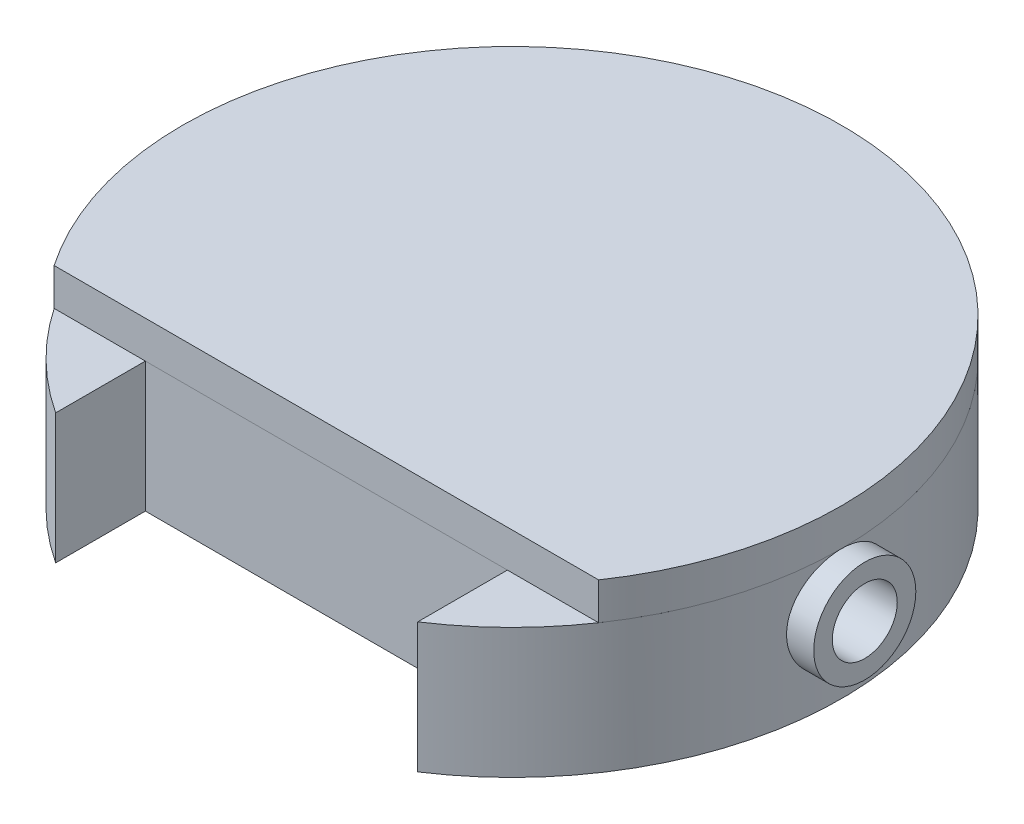
ISO-10303-21;
HEADER;
FILE_DESCRIPTION(('STEP AP214'),'2;1');
FILE_NAME('part.step','',(''),(''),'','','');
FILE_SCHEMA(('AUTOMOTIVE_DESIGN { 1 0 10303 214 1 1 1 1 }'));
ENDSEC;
DATA;
#1=APPLICATION_CONTEXT('core data for automotive mechanical design processes');
#2=APPLICATION_PROTOCOL_DEFINITION('international standard','automotive_design',2000,#1);
#3=PRODUCT_CONTEXT('',#1,'mechanical');
#4=PRODUCT('Part','Part','',(#3));
#5=PRODUCT_RELATED_PRODUCT_CATEGORY('part','',(#4));
#6=PRODUCT_DEFINITION_FORMATION('','',#4);
#7=PRODUCT_DEFINITION_CONTEXT('part definition',#1,'design');
#8=PRODUCT_DEFINITION('design','',#6,#7);
#9=PRODUCT_DEFINITION_SHAPE('','',#8);
#10=(LENGTH_UNIT() NAMED_UNIT(*) SI_UNIT(.MILLI.,.METRE.));
#11=(NAMED_UNIT(*) PLANE_ANGLE_UNIT() SI_UNIT($,.RADIAN.));
#12=(NAMED_UNIT(*) SI_UNIT($,.STERADIAN.) SOLID_ANGLE_UNIT());
#13=UNCERTAINTY_MEASURE_WITH_UNIT(LENGTH_MEASURE(1.E-05),#10,'distance_accuracy_value','');
#14=(GEOMETRIC_REPRESENTATION_CONTEXT(3) GLOBAL_UNCERTAINTY_ASSIGNED_CONTEXT((#13)) GLOBAL_UNIT_ASSIGNED_CONTEXT((#10,
#11,#12)) REPRESENTATION_CONTEXT('',''));
#15=CARTESIAN_POINT('',(0.,0.,0.));
#16=DIRECTION('',(0.,0.,1.));
#17=DIRECTION('',(1.,0.,0.));
#18=AXIS2_PLACEMENT_3D('',#15,#16,#17);
#19=CARTESIAN_POINT('',(-17.7812127220935,-2.51992037915481,11.7403163045634));
#20=DIRECTION('',(0.,-1.,0.));
#21=DIRECTION('',(0.,0.,-1.));
#22=AXIS2_PLACEMENT_3D('',#19,#20,#21);
#23=CYLINDRICAL_SURFACE('',#22,3.55);
#24=CARTESIAN_POINT('',(-17.7812127220935,-2.91992037915481,11.7403163045634));
#25=DIRECTION('',(0.,1.,0.));
#26=DIRECTION('',(0.,0.,1.));
#27=AXIS2_PLACEMENT_3D('',#24,#25,#26);
#28=CIRCLE('',#27,3.55);
#29=CARTESIAN_POINT('',(-14.848210846881,-2.91992037915481,13.7403163045634));
#30=VERTEX_POINT('',#29);
#31=CARTESIAN_POINT('',(-20.714214597306,-2.91992037915481,13.7403163045634));
#32=VERTEX_POINT('',#31);
#33=EDGE_CURVE('E78',#30,#32,#28,.T.);
#34=ORIENTED_EDGE('',*,*,#33,.T.);
#35=DIRECTION('',(0.,-1.,0.));
#36=VECTOR('',#35,1.);
#37=CARTESIAN_POINT('',(-20.714214597306,-2.51992037915481,13.7403163045634));
#38=LINE('',#37,#36);
#39=CARTESIAN_POINT('',(-20.714214597306,-2.51992037915481,13.7403163045634));
#40=VERTEX_POINT('',#39);
#41=EDGE_CURVE('E12',#40,#32,#38,.T.);
#42=ORIENTED_EDGE('',*,*,#41,.F.);
#43=CARTESIAN_POINT('',(-17.7812127220935,-2.51992037915481,11.7403163045634));
#44=DIRECTION('',(0.,1.,0.));
#45=DIRECTION('',(0.,0.,1.));
#46=AXIS2_PLACEMENT_3D('',#43,#44,#45);
#47=CIRCLE('',#46,3.55);
#48=CARTESIAN_POINT('',(-14.848210846881,-2.51992037915481,13.7403163045634));
#49=VERTEX_POINT('',#48);
#50=EDGE_CURVE('E77',#49,#40,#47,.T.);
#51=ORIENTED_EDGE('',*,*,#50,.F.);
#52=DIRECTION('',(0.,-1.,0.));
#53=VECTOR('',#52,1.);
#54=CARTESIAN_POINT('',(-14.848210846881,-2.51992037915481,13.7403163045634));
#55=LINE('',#54,#53);
#56=EDGE_CURVE('E55',#49,#30,#55,.T.);
#57=ORIENTED_EDGE('',*,*,#56,.T.);
#58=EDGE_LOOP('',(#34,#42,#51,#57));
#59=FACE_BOUND('',#58,.T.);
#60=ADVANCED_FACE('F47',(#59),#23,.T.);
#61=CARTESIAN_POINT('',(-20.714214597306,-2.51992037915481,13.7403163045634));
#62=DIRECTION('',(0.,0.,-1.));
#63=DIRECTION('',(-1.,0.,0.));
#64=AXIS2_PLACEMENT_3D('',#61,#62,#63);
#65=PLANE('',#64);
#66=DIRECTION('',(1.,0.,0.));
#67=VECTOR('',#66,1.);
#68=CARTESIAN_POINT('',(-20.714214597306,-2.91992037915481,13.7403163045634));
#69=LINE('',#68,#67);
#70=EDGE_CURVE('E70',#32,#30,#69,.T.);
#71=ORIENTED_EDGE('',*,*,#70,.T.);
#72=ORIENTED_EDGE('',*,*,#56,.F.);
#73=DIRECTION('',(1.,0.,0.));
#74=VECTOR('',#73,1.);
#75=CARTESIAN_POINT('',(-20.714214597306,-2.51992037915481,13.7403163045634));
#76=LINE('',#75,#74);
#77=EDGE_CURVE('E62',#40,#49,#76,.T.);
#78=ORIENTED_EDGE('',*,*,#77,.F.);
#79=ORIENTED_EDGE('',*,*,#41,.T.);
#80=EDGE_LOOP('',(#71,#72,#78,#79));
#81=FACE_BOUND('',#80,.T.);
#82=ADVANCED_FACE('F73',(#81),#65,.F.);
#83=CARTESIAN_POINT('',(-17.7812127220935,-2.51992037915481,11.7403163045634));
#84=DIRECTION('',(0.,1.,0.));
#85=DIRECTION('',(0.,0.,1.));
#86=AXIS2_PLACEMENT_3D('',#83,#84,#85);
#87=PLANE('',#86);
#88=ORIENTED_EDGE('',*,*,#50,.T.);
#89=ORIENTED_EDGE('',*,*,#77,.T.);
#90=EDGE_LOOP('',(#88,#89));
#91=FACE_BOUND('',#90,.T.);
#92=ADVANCED_FACE('F85',(#91),#87,.T.);
#93=CARTESIAN_POINT('',(-17.7812127220935,-2.91992037915481,11.7403163045634));
#94=DIRECTION('',(0.,1.,0.));
#95=DIRECTION('',(0.,0.,1.));
#96=AXIS2_PLACEMENT_3D('',#93,#94,#95);
#97=PLANE('',#96);
#98=ORIENTED_EDGE('',*,*,#33,.F.);
#99=ORIENTED_EDGE('',*,*,#70,.F.);
#100=EDGE_LOOP('',(#98,#99));
#101=FACE_BOUND('',#100,.T.);
#102=ADVANCED_FACE('F81',(#101),#97,.F.);
#103=CLOSED_SHELL('',(#60,#82,#92,#102));
#104=MANIFOLD_SOLID_BREP('B2',#103);
#105=CARTESIAN_POINT('',(-20.4312127220935,-4.31992037915481,11.2403163045634));
#106=DIRECTION('',(-1.,0.,0.));
#107=DIRECTION('',(0.,0.,1.));
#108=AXIS2_PLACEMENT_3D('',#105,#106,#107);
#109=PLANE('',#108);
#110=CARTESIAN_POINT('',(-20.4312127220935,-3.46992037915481,11.7403163045634));
#111=DIRECTION('',(-1.,0.,0.));
#112=DIRECTION('',(0.,0.,1.));
#113=AXIS2_PLACEMENT_3D('',#110,#111,#112);
#114=CIRCLE('',#113,0.35);
#115=CARTESIAN_POINT('',(-20.4312127220935,-3.46992037915481,12.0903163045634));
#116=VERTEX_POINT('',#115);
#117=EDGE_CURVE('E347',#116,#116,#114,.T.);
#118=ORIENTED_EDGE('',*,*,#117,.T.);
#119=EDGE_LOOP('',(#118));
#120=FACE_BOUND('',#119,.T.);
#121=DIRECTION('',(0.,0.,1.));
#122=VECTOR('',#121,1.);
#123=CARTESIAN_POINT('',(-20.4312127220935,-3.01992037915481,11.2403163045634));
#124=LINE('',#123,#122);
#125=CARTESIAN_POINT('',(-20.4312127220935,-3.01992037915481,11.2403163045634));
#126=VERTEX_POINT('',#125);
#127=CARTESIAN_POINT('',(-20.4312127220935,-3.01992037915481,12.2403163045634));
#128=VERTEX_POINT('',#127);
#129=EDGE_CURVE('E206',#126,#128,#124,.T.);
#130=ORIENTED_EDGE('',*,*,#129,.T.);
#131=DIRECTION('',(0.,1.,0.));
#132=VECTOR('',#131,1.);
#133=CARTESIAN_POINT('',(-20.4312127220935,-4.31992037915481,12.2403163045634));
#134=LINE('',#133,#132);
#135=CARTESIAN_POINT('',(-20.4312127220935,-4.31992037915481,12.2403163045634));
#136=VERTEX_POINT('',#135);
#137=EDGE_CURVE('E191',#136,#128,#134,.T.);
#138=ORIENTED_EDGE('',*,*,#137,.F.);
#139=DIRECTION('',(0.,0.,1.));
#140=VECTOR('',#139,1.);
#141=CARTESIAN_POINT('',(-20.4312127220935,-4.31992037915481,11.2403163045634));
#142=LINE('',#141,#140);
#143=CARTESIAN_POINT('',(-20.4312127220935,-4.31992037915481,11.2403163045634));
#144=VERTEX_POINT('',#143);
#145=EDGE_CURVE('E308',#144,#136,#142,.T.);
#146=ORIENTED_EDGE('',*,*,#145,.F.);
#147=DIRECTION('',(0.,1.,0.));
#148=VECTOR('',#147,1.);
#149=CARTESIAN_POINT('',(-20.4312127220935,-4.31992037915481,11.2403163045634));
#150=LINE('',#149,#148);
#151=EDGE_CURVE('E207',#144,#126,#150,.T.);
#152=ORIENTED_EDGE('',*,*,#151,.T.);
#153=EDGE_LOOP('',(#130,#138,#146,#152));
#154=FACE_BOUND('',#153,.T.);
#155=ADVANCED_FACE('F119',(#120,#154),#109,.F.);
#156=CARTESIAN_POINT('',(-20.4312127220935,-4.31992037915481,11.2403163045634));
#157=DIRECTION('',(0.,0.,-1.));
#158=DIRECTION('',(-1.,0.,0.));
#159=AXIS2_PLACEMENT_3D('',#156,#157,#158);
#160=PLANE('',#159);
#161=DIRECTION('',(-1.,0.,0.));
#162=VECTOR('',#161,1.);
#163=CARTESIAN_POINT('',(-20.4312127220935,-3.01992037915481,11.2403163045634));
#164=LINE('',#163,#162);
#165=CARTESIAN_POINT('',(-15.1312127220935,-3.01992037915481,11.2403163045634));
#166=VERTEX_POINT('',#165);
#167=EDGE_CURVE('E136',#166,#126,#164,.T.);
#168=ORIENTED_EDGE('',*,*,#167,.T.);
#169=ORIENTED_EDGE('',*,*,#151,.F.);
#170=DIRECTION('',(-1.,0.,0.));
#171=VECTOR('',#170,1.);
#172=CARTESIAN_POINT('',(-20.4312127220935,-4.31992037915481,11.2403163045634));
#173=LINE('',#172,#171);
#174=CARTESIAN_POINT('',(-15.1312127220935,-4.31992037915481,11.2403163045634));
#175=VERTEX_POINT('',#174);
#176=EDGE_CURVE('E203',#175,#144,#173,.T.);
#177=ORIENTED_EDGE('',*,*,#176,.F.);
#178=DIRECTION('',(0.,1.,0.));
#179=VECTOR('',#178,1.);
#180=CARTESIAN_POINT('',(-15.1312127220935,-4.31992037915481,11.2403163045634));
#181=LINE('',#180,#179);
#182=EDGE_CURVE('E321',#175,#166,#181,.T.);
#183=ORIENTED_EDGE('',*,*,#182,.T.);
#184=EDGE_LOOP('',(#168,#169,#177,#183));
#185=FACE_BOUND('',#184,.T.);
#186=ADVANCED_FACE('F248',(#185),#160,.F.);
#187=CARTESIAN_POINT('',(-15.1312127220935,-4.31992037915481,11.2403163045634));
#188=DIRECTION('',(1.,0.,0.));
#189=DIRECTION('',(0.,0.,-1.));
#190=AXIS2_PLACEMENT_3D('',#187,#188,#189);
#191=PLANE('',#190);
#192=CARTESIAN_POINT('',(-15.1312127220935,-3.46992037915481,11.7403163045634));
#193=DIRECTION('',(1.,0.,0.));
#194=DIRECTION('',(0.,0.,-1.));
#195=AXIS2_PLACEMENT_3D('',#192,#193,#194);
#196=CIRCLE('',#195,0.35);
#197=CARTESIAN_POINT('',(-15.1312127220935,-3.46992037915481,11.3903163045634));
#198=VERTEX_POINT('',#197);
#199=EDGE_CURVE('E123',#198,#198,#196,.T.);
#200=ORIENTED_EDGE('',*,*,#199,.T.);
#201=EDGE_LOOP('',(#200));
#202=FACE_BOUND('',#201,.T.);
#203=DIRECTION('',(0.,0.,-1.));
#204=VECTOR('',#203,1.);
#205=CARTESIAN_POINT('',(-15.1312127220935,-3.01992037915481,11.2403163045634));
#206=LINE('',#205,#204);
#207=CARTESIAN_POINT('',(-15.1312127220935,-3.01992037915481,12.2403163045634));
#208=VERTEX_POINT('',#207);
#209=EDGE_CURVE('E144',#208,#166,#206,.T.);
#210=ORIENTED_EDGE('',*,*,#209,.T.);
#211=ORIENTED_EDGE('',*,*,#182,.F.);
#212=DIRECTION('',(0.,0.,-1.));
#213=VECTOR('',#212,1.);
#214=CARTESIAN_POINT('',(-15.1312127220935,-4.31992037915481,11.2403163045634));
#215=LINE('',#214,#213);
#216=CARTESIAN_POINT('',(-15.1312127220935,-4.31992037915481,12.2403163045634));
#217=VERTEX_POINT('',#216);
#218=EDGE_CURVE('E314',#217,#175,#215,.T.);
#219=ORIENTED_EDGE('',*,*,#218,.F.);
#220=DIRECTION('',(0.,1.,0.));
#221=VECTOR('',#220,1.);
#222=CARTESIAN_POINT('',(-15.1312127220935,-4.31992037915481,12.2403163045634));
#223=LINE('',#222,#221);
#224=EDGE_CURVE('E202',#217,#208,#223,.T.);
#225=ORIENTED_EDGE('',*,*,#224,.T.);
#226=EDGE_LOOP('',(#210,#211,#219,#225));
#227=FACE_BOUND('',#226,.T.);
#228=ADVANCED_FACE('F254',(#202,#227),#191,.F.);
#229=CARTESIAN_POINT('',(-20.4312127220935,-4.31992037915481,12.2403163045634));
#230=DIRECTION('',(0.,0.,1.));
#231=DIRECTION('',(1.,0.,0.));
#232=AXIS2_PLACEMENT_3D('',#229,#230,#231);
#233=PLANE('',#232);
#234=DIRECTION('',(1.,0.,0.));
#235=VECTOR('',#234,1.);
#236=CARTESIAN_POINT('',(-20.4312127220935,-3.01992037915481,12.2403163045634));
#237=LINE('',#236,#235);
#238=EDGE_CURVE('E196',#128,#208,#237,.T.);
#239=ORIENTED_EDGE('',*,*,#238,.T.);
#240=ORIENTED_EDGE('',*,*,#224,.F.);
#241=DIRECTION('',(1.,0.,0.));
#242=VECTOR('',#241,1.);
#243=CARTESIAN_POINT('',(-20.4312127220935,-4.31992037915481,12.2403163045634));
#244=LINE('',#243,#242);
#245=EDGE_CURVE('E198',#136,#217,#244,.T.);
#246=ORIENTED_EDGE('',*,*,#245,.F.);
#247=ORIENTED_EDGE('',*,*,#137,.T.);
#248=EDGE_LOOP('',(#239,#240,#246,#247));
#249=FACE_BOUND('',#248,.T.);
#250=ADVANCED_FACE('F193',(#249),#233,.F.);
#251=CARTESIAN_POINT('',(-17.7812127220935,-4.31992037915481,11.7403163045634));
#252=DIRECTION('',(0.,1.,0.));
#253=DIRECTION('',(0.,0.,1.));
#254=AXIS2_PLACEMENT_3D('',#251,#252,#253);
#255=CYLINDRICAL_SURFACE('',#254,3.55);
#256=CARTESIAN_POINT('',(-17.7812127220935,-2.91992037915481,11.7403163045634));
#257=DIRECTION('',(0.,1.,0.));
#258=DIRECTION('',(0.,0.,1.));
#259=AXIS2_PLACEMENT_3D('',#256,#257,#258);
#260=CIRCLE('',#259,3.55);
#261=CARTESIAN_POINT('',(-21.3312127220935,-2.91992037915481,11.7403163045634));
#262=VERTEX_POINT('',#261);
#263=CARTESIAN_POINT('',(-19.7312127220935,-2.91992037915481,14.7067956994016));
#264=VERTEX_POINT('',#263);
#265=EDGE_CURVE('E302',#262,#264,#260,.T.);
#266=ORIENTED_EDGE('',*,*,#265,.F.);
#267=CARTESIAN_POINT('',(-21.2883483054435,-3.46992037915481,12.2903163045634));
#268=CARTESIAN_POINT('',(-21.2883488314093,-3.43922620789478,12.2903150460279));
#269=CARTESIAN_POINT('',(-21.2887556172467,-3.40851451955331,12.2877381607792));
#270=CARTESIAN_POINT('',(-21.2903375974219,-3.34795067750194,12.277501937795));
#271=CARTESIAN_POINT('',(-21.291513529585,-3.31809937788105,12.2698377197868));
#272=CARTESIAN_POINT('',(-21.2944974905001,-3.26014168195777,12.2496623780376));
#273=CARTESIAN_POINT('',(-21.2963050217552,-3.23203393275747,12.2371550682584));
#274=CARTESIAN_POINT('',(-21.3003479275861,-3.17831972105179,12.2076577139292));
#275=CARTESIAN_POINT('',(-21.3025832463289,-3.15271293278981,12.1906682542607));
#276=CARTESIAN_POINT('',(-21.3072511856874,-3.10450531635259,12.1525340990673));
#277=CARTESIAN_POINT('',(-21.3096851820734,-3.08192892460719,12.1313586764602));
#278=CARTESIAN_POINT('',(-21.3144639642983,-3.04063486381272,12.0855200562523));
#279=CARTESIAN_POINT('',(-21.3168087451193,-3.02191741155134,12.0608566628352));
#280=CARTESIAN_POINT('',(-21.3211593463988,-2.98878193065924,12.0085851283517));
#281=CARTESIAN_POINT('',(-21.3231633642913,-2.9743864753034,11.9809625150244));
#282=CARTESIAN_POINT('',(-21.3265913823429,-2.95044854852554,11.9236551869857));
#283=CARTESIAN_POINT('',(-21.3280154151548,-2.94090580389144,11.8939705884728));
#284=CARTESIAN_POINT('',(-21.3301133054731,-2.92701845408991,11.8336338372086));
#285=CARTESIAN_POINT('',(-21.3307930715666,-2.92263288617668,11.8029913213794));
#286=CARTESIAN_POINT('',(-21.3313461021479,-2.9190571351152,11.7413983171661));
#287=CARTESIAN_POINT('',(-21.3312194143199,-2.91986664479087,11.7104478470988));
#288=CARTESIAN_POINT('',(-21.330178519841,-2.9266258523474,11.649397148301));
#289=CARTESIAN_POINT('',(-21.3292710658148,-2.93253147666849,11.6192919084724));
#290=CARTESIAN_POINT('',(-21.3267781238942,-2.94924603074569,11.5605049363091));
#291=CARTESIAN_POINT('',(-21.3251926176114,-2.96005509348062,11.5318232426036));
#292=CARTESIAN_POINT('',(-21.3215101421498,-2.98631443708642,11.4765647952748));
#293=CARTESIAN_POINT('',(-21.3194111470426,-3.00178315960646,11.4499969458062));
#294=CARTESIAN_POINT('',(-21.3149354191117,-3.03690924527026,11.3998174287039));
#295=CARTESIAN_POINT('',(-21.3125586668101,-3.05656690224414,11.3762059686288));
#296=CARTESIAN_POINT('',(-21.3077628493435,-3.09975806811804,11.3323494995347));
#297=CARTESIAN_POINT('',(-21.3053436018494,-3.1233300692335,11.3121424001848));
#298=CARTESIAN_POINT('',(-21.3007597182671,-3.17355033327144,11.2759645897782));
#299=CARTESIAN_POINT('',(-21.2985950839521,-3.20019861761661,11.2599939082259));
#300=CARTESIAN_POINT('',(-21.294765521448,-3.25585578295908,11.232736498945));
#301=CARTESIAN_POINT('',(-21.2931010295985,-3.28486669730681,11.2214538579404));
#302=CARTESIAN_POINT('',(-21.2904677822646,-3.34440331592863,11.2039319495664));
#303=CARTESIAN_POINT('',(-21.2894989742941,-3.37492890574213,11.1976923017237));
#304=CARTESIAN_POINT('',(-21.2883768003028,-3.43629053556162,11.1904858878323));
#305=CARTESIAN_POINT('',(-21.2882151107118,-3.46712010720004,11.1894652965254));
#306=CARTESIAN_POINT('',(-21.2887033615792,-3.52850988852193,11.1925829685511));
#307=CARTESIAN_POINT('',(-21.2893532751079,-3.55907010710888,11.1967210607137));
#308=CARTESIAN_POINT('',(-21.2913838445929,-3.61888573411599,11.2099929140109));
#309=CARTESIAN_POINT('',(-21.2927605525045,-3.64814727500871,11.2190996934345));
#310=CARTESIAN_POINT('',(-21.2960863183922,-3.70472866901093,11.2420222804468));
#311=CARTESIAN_POINT('',(-21.2980354063601,-3.73204842028106,11.2558383347988));
#312=CARTESIAN_POINT('',(-21.3023058523225,-3.78421151780556,11.2879159529518));
#313=CARTESIAN_POINT('',(-21.3046300688299,-3.80903326083083,11.3062122596977));
#314=CARTESIAN_POINT('',(-21.3093803537017,-3.85527330512076,11.346682894936));
#315=CARTESIAN_POINT('',(-21.3118064282166,-3.87669140048691,11.3688574578674));
#316=CARTESIAN_POINT('',(-21.3165131758751,-3.91571039763821,11.4166926046699));
#317=CARTESIAN_POINT('',(-21.3187923598139,-3.93327556391121,11.4423825062388));
#318=CARTESIAN_POINT('',(-21.3229251725144,-3.96384073929924,11.4963797022014));
#319=CARTESIAN_POINT('',(-21.324778813543,-3.97684088001414,11.5246869211138));
#320=CARTESIAN_POINT('',(-21.3278451754227,-3.99785030265149,11.5830051909144));
#321=CARTESIAN_POINT('',(-21.3290603717899,-4.00587888335761,11.6130091536421));
#322=CARTESIAN_POINT('',(-21.3307233376613,-4.01677965527753,11.6739596885275));
#323=CARTESIAN_POINT('',(-21.3311711613888,-4.01965221082151,11.7049061939271));
#324=CARTESIAN_POINT('',(-21.3312483174546,-4.02015004425025,11.7665172463864));
#325=CARTESIAN_POINT('',(-21.3308861649544,-4.01782991192496,11.7971813555865));
#326=CARTESIAN_POINT('',(-21.3294012908559,-4.00812554383048,11.8576777268226));
#327=CARTESIAN_POINT('',(-21.3282785721805,-4.00074132752237,11.8875099920549));
#328=CARTESIAN_POINT('',(-21.3253981617592,-3.98113822832932,11.9454791764073));
#329=CARTESIAN_POINT('',(-21.3236409990963,-3.96892337306117,11.9736174854261));
#330=CARTESIAN_POINT('',(-21.3196843623483,-3.94001162102193,12.0274537485158));
#331=CARTESIAN_POINT('',(-21.3174848719881,-3.92331455932327,12.0531516127408));
#332=CARTESIAN_POINT('',(-21.3128604218541,-3.88571606122135,12.1016538792845));
#333=CARTESIAN_POINT('',(-21.3104334347492,-3.86477440884306,12.1244269162869));
#334=CARTESIAN_POINT('',(-21.3056422453199,-3.81936578488698,12.1661552903107));
#335=CARTESIAN_POINT('',(-21.3032780578499,-3.79489798788507,12.1851097309506));
#336=CARTESIAN_POINT('',(-21.2988648445572,-3.74295774334802,12.2187661450187));
#337=CARTESIAN_POINT('',(-21.2968178031704,-3.71546808283709,12.2334418123285));
#338=CARTESIAN_POINT('',(-21.2932939669995,-3.65839467337184,12.257945420048));
#339=CARTESIAN_POINT('',(-21.2918165870462,-3.6288131104421,12.2677783379343));
#340=CARTESIAN_POINT('',(-21.2899367967534,-3.57757304654583,12.2801130166795));
#341=CARTESIAN_POINT('',(-21.2893443142936,-3.55622932771448,12.2839333150836));
#342=CARTESIAN_POINT('',(-21.2885498858516,-3.51323343726757,12.2890353848992));
#343=CARTESIAN_POINT('',(-21.2883479342692,-3.49158127007961,12.2903171927125));
#344=CARTESIAN_POINT('',(-21.2883483054435,-3.46992037915481,12.2903163045634));
#345=B_SPLINE_CURVE_WITH_KNOTS('',3,(#267,#268,#269,#270,#271,#272,#273,#274,#275,#276,#277,
#278,#279,#280,#281,#282,#283,#284,#285,#286,#287,#288,#289,#290,#291,#292,#293,#294,#295,#296,
#297,#298,#299,#300,#301,#302,#303,#304,#305,#306,#307,#308,#309,#310,#311,#312,#313,#314,#315,
#316,#317,#318,#319,#320,#321,#322,#323,#324,#325,#326,#327,#328,#329,#330,#331,#332,#333,#334,
#335,#336,#337,#338,#339,#340,#341,#342,#343,#344),.UNSPECIFIED.,.T.,.F.,(4,2,2,2,2,2,2,2,2,2,2,
2,2,2,2,2,2,2,2,2,2,2,2,2,2,2,2,2,2,2,2,2,2,2,2,2,2,2,4),(0.,0.0920033304865069,
0.18409504746144,0.276114388703854,0.368121728161346,0.460831360078459,0.553546198823214,
0.646737173439557,0.739922900736928,0.832363357091382,0.924798347649802,1.01644183942731,
1.10808781667938,1.20010137831443,1.29212139630766,1.38510664209892,1.47809253546224,
1.57115931857424,1.66421907951907,1.75631713123406,1.8484121271299,1.94001192169636,
2.0316165167792,2.12395531690607,2.21629970080433,2.30946740043299,2.40263241401684,
2.49543347112756,2.58822797055955,2.68005152545478,2.77187472747764,2.86362153140944,
2.95537171172583,3.0480356474911,3.14072131000675,3.23396534045337,3.32711333172957,
3.39204105588101,3.45696784896833),.UNSPECIFIED.);
#346=EDGE_CURVE('E215',#262,#262,#345,.T.);
#347=ORIENTED_EDGE('',*,*,#346,.F.);
#348=CARTESIAN_POINT('',(-14.2312127220935,-2.91992037915481,11.7403163045634));
#349=VERTEX_POINT('',#348);
#350=EDGE_CURVE('E343',#349,#262,#260,.T.);
#351=ORIENTED_EDGE('',*,*,#350,.F.);
#352=CARTESIAN_POINT('',(-14.2740771387435,-3.46992037915481,11.1903163045634));
#353=CARTESIAN_POINT('',(-14.2740766127776,-3.50061455041484,11.1903175630989));
#354=CARTESIAN_POINT('',(-14.2736698269403,-3.5313262387563,11.1928944483475));
#355=CARTESIAN_POINT('',(-14.2720878467651,-3.59189008080767,11.2031306713318));
#356=CARTESIAN_POINT('',(-14.270911914602,-3.62174138042856,11.2107948893399));
#357=CARTESIAN_POINT('',(-14.2679279536868,-3.67969907635184,11.2309702310892));
#358=CARTESIAN_POINT('',(-14.2661204224318,-3.70780682555214,11.2434775408684));
#359=CARTESIAN_POINT('',(-14.2620775166009,-3.76152103725783,11.2729748951975));
#360=CARTESIAN_POINT('',(-14.2598421978581,-3.7871278255198,11.2899643548661));
#361=CARTESIAN_POINT('',(-14.2551742584996,-3.83533544195702,11.3280985100595));
#362=CARTESIAN_POINT('',(-14.2527402621136,-3.85791183370243,11.3492739326666));
#363=CARTESIAN_POINT('',(-14.2479614798886,-3.89920589449689,11.3951125528745));
#364=CARTESIAN_POINT('',(-14.2456166990677,-3.91792334675827,11.4197759462915));
#365=CARTESIAN_POINT('',(-14.2412660977882,-3.95105882765037,11.4720474807751));
#366=CARTESIAN_POINT('',(-14.2392620798956,-3.96545428300622,11.4996700941023));
#367=CARTESIAN_POINT('',(-14.2358340618441,-3.98939220978407,11.5569774221411));
#368=CARTESIAN_POINT('',(-14.2344100290322,-3.99893495441817,11.586662020654));
#369=CARTESIAN_POINT('',(-14.2323121387139,-4.0128223042197,11.6469987719182));
#370=CARTESIAN_POINT('',(-14.2316323726204,-4.01720787213293,11.6776412877474));
#371=CARTESIAN_POINT('',(-14.2310793420391,-4.02078362319441,11.7392342919607));
#372=CARTESIAN_POINT('',(-14.2312060298671,-4.01997411351874,11.7701847620279));
#373=CARTESIAN_POINT('',(-14.232246924346,-4.01321490596221,11.8312354608258));
#374=CARTESIAN_POINT('',(-14.2331543783722,-4.00730928164112,11.8613407006543));
#375=CARTESIAN_POINT('',(-14.2356473202928,-3.99059472756392,11.9201276728176));
#376=CARTESIAN_POINT('',(-14.2372328265755,-3.979785664829,11.9488093665231));
#377=CARTESIAN_POINT('',(-14.2409153020371,-3.95352632122319,12.004067813852));
#378=CARTESIAN_POINT('',(-14.2430142971443,-3.93805759870315,12.0306356633205));
#379=CARTESIAN_POINT('',(-14.2474900250753,-3.90293151303935,12.0808151804228));
#380=CARTESIAN_POINT('',(-14.2498667773769,-3.88327385606547,12.1044266404979));
#381=CARTESIAN_POINT('',(-14.2546625948435,-3.84008269019157,12.148283109592));
#382=CARTESIAN_POINT('',(-14.2570818423375,-3.81651068907611,12.168490208942));
#383=CARTESIAN_POINT('',(-14.2616657259199,-3.76629042503817,12.2046680193485));
#384=CARTESIAN_POINT('',(-14.2638303602349,-3.739642140693,12.2206387009009));
#385=CARTESIAN_POINT('',(-14.2676599227389,-3.68398497535053,12.2478961101817));
#386=CARTESIAN_POINT('',(-14.2693244145884,-3.6549740610028,12.2591787511864));
#387=CARTESIAN_POINT('',(-14.2719576619224,-3.59543744238098,12.2767006595604));
#388=CARTESIAN_POINT('',(-14.2729264698928,-3.56491185256748,12.2829403074031));
#389=CARTESIAN_POINT('',(-14.2740486438842,-3.503550222748,12.2901467212944));
#390=CARTESIAN_POINT('',(-14.2742103334752,-3.47272065110957,12.2911673126014));
#391=CARTESIAN_POINT('',(-14.2737220826078,-3.41133086978769,12.2880496405757));
#392=CARTESIAN_POINT('',(-14.2730721690791,-3.38077065120073,12.283911548413));
#393=CARTESIAN_POINT('',(-14.2710415995941,-3.32095502419362,12.2706396951159));
#394=CARTESIAN_POINT('',(-14.2696648916825,-3.2916934833009,12.2615329156923));
#395=CARTESIAN_POINT('',(-14.2663391257947,-3.23511208929868,12.23861032868));
#396=CARTESIAN_POINT('',(-14.2643900378269,-3.20779233802855,12.2247942743279));
#397=CARTESIAN_POINT('',(-14.2601195918645,-3.15562924050405,12.1927166561749));
#398=CARTESIAN_POINT('',(-14.2577953753571,-3.13080749747878,12.1744203494291));
#399=CARTESIAN_POINT('',(-14.2530450904853,-3.08456745318885,12.1339497141907));
#400=CARTESIAN_POINT('',(-14.2506190159704,-3.0631493578227,12.1117751512594));
#401=CARTESIAN_POINT('',(-14.2459122683119,-3.0241303606714,12.0639400044568));
#402=CARTESIAN_POINT('',(-14.2436330843731,-3.0065651943984,12.0382501028879));
#403=CARTESIAN_POINT('',(-14.2395002716726,-2.97600001901037,11.9842529069253));
#404=CARTESIAN_POINT('',(-14.2376466306439,-2.96299987829547,11.955945688013));
#405=CARTESIAN_POINT('',(-14.2345802687642,-2.94199045565812,11.8976274182124));
#406=CARTESIAN_POINT('',(-14.2333650723971,-2.933961874952,11.8676234554847));
#407=CARTESIAN_POINT('',(-14.2317021065257,-2.92306110303208,11.8066729205992));
#408=CARTESIAN_POINT('',(-14.2312542827982,-2.92018854748811,11.7757264151996));
#409=CARTESIAN_POINT('',(-14.2311771267323,-2.91969071405937,11.7141153627403));
#410=CARTESIAN_POINT('',(-14.2315392792326,-2.92201084638465,11.6834512535402));
#411=CARTESIAN_POINT('',(-14.2330241533311,-2.93171521447913,11.6229548823041));
#412=CARTESIAN_POINT('',(-14.2341468720065,-2.93909943078724,11.5931226170718));
#413=CARTESIAN_POINT('',(-14.2370272824278,-2.95870252998029,11.5351534327194));
#414=CARTESIAN_POINT('',(-14.2387844450907,-2.97091738524844,11.5070151237007));
#415=CARTESIAN_POINT('',(-14.2427410818387,-2.99982913728768,11.453178860611));
#416=CARTESIAN_POINT('',(-14.2449405721989,-3.01652619898635,11.4274809963859));
#417=CARTESIAN_POINT('',(-14.2495650223328,-3.05412469708826,11.3789787298423));
#418=CARTESIAN_POINT('',(-14.2519920094378,-3.07506634946655,11.3562056928398));
#419=CARTESIAN_POINT('',(-14.2567831988671,-3.12047497342263,11.3144773188161));
#420=CARTESIAN_POINT('',(-14.259147386337,-3.14494277042454,11.2955228781761));
#421=CARTESIAN_POINT('',(-14.2635605996298,-3.1968830149616,11.2618664641081));
#422=CARTESIAN_POINT('',(-14.2656076410165,-3.22437267547253,11.2471907967983));
#423=CARTESIAN_POINT('',(-14.2691314771875,-3.28144608493777,11.2226871890788));
#424=CARTESIAN_POINT('',(-14.2706088571408,-3.31102764786752,11.2128542711925));
#425=CARTESIAN_POINT('',(-14.2724886474336,-3.36226771176379,11.2005195924472));
#426=CARTESIAN_POINT('',(-14.2730811298933,-3.38361143059513,11.1966992940432));
#427=CARTESIAN_POINT('',(-14.2738755583353,-3.42660732104204,11.1915972242275));
#428=CARTESIAN_POINT('',(-14.2740775099178,-3.44825948823001,11.1903154164143));
#429=CARTESIAN_POINT('',(-14.2740771387435,-3.46992037915481,11.1903163045634));
#430=B_SPLINE_CURVE_WITH_KNOTS('',3,(#352,#353,#354,#355,#356,#357,#358,#359,#360,#361,#362,
#363,#364,#365,#366,#367,#368,#369,#370,#371,#372,#373,#374,#375,#376,#377,#378,#379,#380,#381,
#382,#383,#384,#385,#386,#387,#388,#389,#390,#391,#392,#393,#394,#395,#396,#397,#398,#399,#400,
#401,#402,#403,#404,#405,#406,#407,#408,#409,#410,#411,#412,#413,#414,#415,#416,#417,#418,#419,
#420,#421,#422,#423,#424,#425,#426,#427,#428,#429),.UNSPECIFIED.,.T.,.F.,(4,2,2,2,2,2,2,2,2,2,2,
2,2,2,2,2,2,2,2,2,2,2,2,2,2,2,2,2,2,2,2,2,2,2,2,2,2,2,4),(0.,0.0920033304865077,
0.184095047461441,0.276114388703856,0.368121728161346,0.46083136007846,0.553546198823214,
0.646737173439556,0.73992290073693,0.832363357091387,0.924798347649802,1.01644183942731,
1.10808781667938,1.20010137831443,1.29212139630766,1.38510664209892,1.47809253546224,
1.57115931857424,1.66421907951907,1.75631713123406,1.8484121271299,1.94001192169636,
2.0316165167792,2.12395531690607,2.21629970080434,2.30946740043299,2.40263241401684,
2.49543347112757,2.58822797055955,2.68005152545479,2.77187472747764,2.86362153140944,
2.95537171172583,3.04803564749111,3.14072131000675,3.23396534045337,3.32711333172957,
3.39204105588101,3.45696784896833),.UNSPECIFIED.);
#431=EDGE_CURVE('E219',#349,#349,#430,.T.);
#432=ORIENTED_EDGE('',*,*,#431,.T.);
#433=CARTESIAN_POINT('',(-15.8312127220935,-2.91992037915481,14.7067956994016));
#434=VERTEX_POINT('',#433);
#435=EDGE_CURVE('E304',#434,#349,#260,.T.);
#436=ORIENTED_EDGE('',*,*,#435,.F.);
#437=DIRECTION('',(0.,1.,0.));
#438=VECTOR('',#437,1.);
#439=CARTESIAN_POINT('',(-15.8312127220935,-4.31992037915481,14.7067956994016));
#440=LINE('',#439,#438);
#441=CARTESIAN_POINT('',(-15.8312127220935,-4.31992037915481,14.7067956994016));
#442=VERTEX_POINT('',#441);
#443=EDGE_CURVE('E45',#442,#434,#440,.T.);
#444=ORIENTED_EDGE('',*,*,#443,.F.);
#445=CARTESIAN_POINT('',(-17.7812127220935,-4.31992037915481,11.7403163045634));
#446=DIRECTION('',(0.,1.,0.));
#447=DIRECTION('',(0.,0.,1.));
#448=AXIS2_PLACEMENT_3D('',#445,#446,#447);
#449=CIRCLE('',#448,3.55);
#450=CARTESIAN_POINT('',(-19.7312127220935,-4.31992037915481,14.7067956994016));
#451=VERTEX_POINT('',#450);
#452=EDGE_CURVE('E326',#442,#451,#449,.T.);
#453=ORIENTED_EDGE('',*,*,#452,.T.);
#454=DIRECTION('',(0.,1.,0.));
#455=VECTOR('',#454,1.);
#456=CARTESIAN_POINT('',(-19.7312127220935,-4.31992037915481,14.7067956994016));
#457=LINE('',#456,#455);
#458=EDGE_CURVE('E292',#451,#264,#457,.T.);
#459=ORIENTED_EDGE('',*,*,#458,.T.);
#460=EDGE_LOOP('',(#266,#347,#351,#432,#436,#444,#453,#459));
#461=FACE_BOUND('',#460,.T.);
#462=ADVANCED_FACE('F121',(#461),#255,.T.);
#463=CARTESIAN_POINT('',(-15.8312127220935,-4.31992037915481,14.7067956994016));
#464=DIRECTION('',(-1.,0.,0.));
#465=DIRECTION('',(0.,0.,1.));
#466=AXIS2_PLACEMENT_3D('',#463,#464,#465);
#467=PLANE('',#466);
#468=ORIENTED_EDGE('',*,*,#443,.T.);
#469=DIRECTION('',(0.,0.,1.));
#470=VECTOR('',#469,1.);
#471=CARTESIAN_POINT('',(-15.8312127220935,-2.91992037915481,14.7067956994016));
#472=LINE('',#471,#470);
#473=CARTESIAN_POINT('',(-15.8312127220935,-2.91992037915481,13.7403163045634));
#474=VERTEX_POINT('',#473);
#475=EDGE_CURVE('E306',#474,#434,#472,.T.);
#476=ORIENTED_EDGE('',*,*,#475,.F.);
#477=DIRECTION('',(0.,1.,0.));
#478=VECTOR('',#477,1.);
#479=CARTESIAN_POINT('',(-15.8312127220935,-4.31992037915481,13.7403163045634));
#480=LINE('',#479,#478);
#481=CARTESIAN_POINT('',(-15.8312127220935,-4.31992037915481,13.7403163045634));
#482=VERTEX_POINT('',#481);
#483=EDGE_CURVE('E128',#482,#474,#480,.T.);
#484=ORIENTED_EDGE('',*,*,#483,.F.);
#485=DIRECTION('',(0.,0.,1.));
#486=VECTOR('',#485,1.);
#487=CARTESIAN_POINT('',(-15.8312127220935,-4.31992037915481,14.7067956994016));
#488=LINE('',#487,#486);
#489=EDGE_CURVE('E331',#482,#442,#488,.T.);
#490=ORIENTED_EDGE('',*,*,#489,.T.);
#491=EDGE_LOOP('',(#468,#476,#484,#490));
#492=FACE_BOUND('',#491,.T.);
#493=ADVANCED_FACE('F270',(#492),#467,.T.);
#494=CARTESIAN_POINT('',(-19.7312127220935,-4.31992037915481,13.7403163045634));
#495=DIRECTION('',(0.,0.,1.));
#496=DIRECTION('',(1.,0.,0.));
#497=AXIS2_PLACEMENT_3D('',#494,#495,#496);
#498=PLANE('',#497);
#499=ORIENTED_EDGE('',*,*,#483,.T.);
#500=DIRECTION('',(1.,0.,0.));
#501=VECTOR('',#500,1.);
#502=CARTESIAN_POINT('',(-19.7312127220935,-2.91992037915481,13.7403163045634));
#503=LINE('',#502,#501);
#504=CARTESIAN_POINT('',(-19.7312127220935,-2.91992037915481,13.7403163045634));
#505=VERTEX_POINT('',#504);
#506=EDGE_CURVE('E298',#505,#474,#503,.T.);
#507=ORIENTED_EDGE('',*,*,#506,.F.);
#508=DIRECTION('',(0.,1.,0.));
#509=VECTOR('',#508,1.);
#510=CARTESIAN_POINT('',(-19.7312127220935,-4.31992037915481,13.7403163045634));
#511=LINE('',#510,#509);
#512=CARTESIAN_POINT('',(-19.7312127220935,-4.31992037915481,13.7403163045634));
#513=VERTEX_POINT('',#512);
#514=EDGE_CURVE('E283',#513,#505,#511,.T.);
#515=ORIENTED_EDGE('',*,*,#514,.F.);
#516=DIRECTION('',(1.,0.,0.));
#517=VECTOR('',#516,1.);
#518=CARTESIAN_POINT('',(-19.7312127220935,-4.31992037915481,13.7403163045634));
#519=LINE('',#518,#517);
#520=EDGE_CURVE('E329',#513,#482,#519,.T.);
#521=ORIENTED_EDGE('',*,*,#520,.T.);
#522=EDGE_LOOP('',(#499,#507,#515,#521));
#523=FACE_BOUND('',#522,.T.);
#524=ADVANCED_FACE('F273',(#523),#498,.T.);
#525=CARTESIAN_POINT('',(-19.7312127220935,-4.31992037915481,14.7067956994016));
#526=DIRECTION('',(1.,0.,0.));
#527=DIRECTION('',(0.,0.,-1.));
#528=AXIS2_PLACEMENT_3D('',#525,#526,#527);
#529=PLANE('',#528);
#530=ORIENTED_EDGE('',*,*,#514,.T.);
#531=DIRECTION('',(0.,0.,-1.));
#532=VECTOR('',#531,1.);
#533=CARTESIAN_POINT('',(-19.7312127220935,-2.91992037915481,14.7067956994016));
#534=LINE('',#533,#532);
#535=EDGE_CURVE('E286',#264,#505,#534,.T.);
#536=ORIENTED_EDGE('',*,*,#535,.F.);
#537=ORIENTED_EDGE('',*,*,#458,.F.);
#538=DIRECTION('',(0.,0.,-1.));
#539=VECTOR('',#538,1.);
#540=CARTESIAN_POINT('',(-19.7312127220935,-4.31992037915481,14.7067956994016));
#541=LINE('',#540,#539);
#542=EDGE_CURVE('E288',#451,#513,#541,.T.);
#543=ORIENTED_EDGE('',*,*,#542,.T.);
#544=EDGE_LOOP('',(#530,#536,#537,#543));
#545=FACE_BOUND('',#544,.T.);
#546=ADVANCED_FACE('F268',(#545),#529,.T.);
#547=CARTESIAN_POINT('',(-17.7812127220935,-4.31992037915481,11.7403163045634));
#548=DIRECTION('',(0.,1.,0.));
#549=DIRECTION('',(0.,0.,1.));
#550=AXIS2_PLACEMENT_3D('',#547,#548,#549);
#551=PLANE('',#550);
#552=ORIENTED_EDGE('',*,*,#176,.T.);
#553=ORIENTED_EDGE('',*,*,#145,.T.);
#554=ORIENTED_EDGE('',*,*,#245,.T.);
#555=ORIENTED_EDGE('',*,*,#218,.T.);
#556=EDGE_LOOP('',(#552,#553,#554,#555));
#557=FACE_BOUND('',#556,.T.);
#558=CARTESIAN_POINT('',(-17.7812127220935,-4.31992037915481,9.01531630456338));
#559=DIRECTION('',(0.,1.,0.));
#560=DIRECTION('',(0.,0.,1.));
#561=AXIS2_PLACEMENT_3D('',#558,#559,#560);
#562=CIRCLE('',#561,0.525);
#563=CARTESIAN_POINT('',(-17.7812127220935,-4.31992037915481,9.54031630456337));
#564=VERTEX_POINT('',#563);
#565=EDGE_CURVE('E320',#564,#564,#562,.T.);
#566=ORIENTED_EDGE('',*,*,#565,.T.);
#567=EDGE_LOOP('',(#566));
#568=FACE_BOUND('',#567,.T.);
#569=ORIENTED_EDGE('',*,*,#452,.F.);
#570=ORIENTED_EDGE('',*,*,#489,.F.);
#571=ORIENTED_EDGE('',*,*,#520,.F.);
#572=ORIENTED_EDGE('',*,*,#542,.F.);
#573=EDGE_LOOP('',(#569,#570,#571,#572));
#574=FACE_BOUND('',#573,.T.);
#575=ADVANCED_FACE('F264',(#557,#568,#574),#551,.F.);
#576=CARTESIAN_POINT('',(-17.7812127220935,-4.31992037915481,9.01531630456338));
#577=DIRECTION('',(0.,1.,0.));
#578=DIRECTION('',(0.,0.,1.));
#579=AXIS2_PLACEMENT_3D('',#576,#577,#578);
#580=CYLINDRICAL_SURFACE('',#579,0.525);
#581=ORIENTED_EDGE('',*,*,#565,.F.);
#582=EDGE_LOOP('',(#581));
#583=FACE_BOUND('',#582,.T.);
#584=CARTESIAN_POINT('',(-17.7812127220935,-2.91992037915481,9.01531630456338));
#585=DIRECTION('',(0.,1.,0.));
#586=DIRECTION('',(0.,0.,1.));
#587=AXIS2_PLACEMENT_3D('',#584,#585,#586);
#588=CIRCLE('',#587,0.525);
#589=CARTESIAN_POINT('',(-17.7812127220935,-2.91992037915481,9.54031630456337));
#590=VERTEX_POINT('',#589);
#591=EDGE_CURVE('E345',#590,#590,#588,.T.);
#592=ORIENTED_EDGE('',*,*,#591,.T.);
#593=EDGE_LOOP('',(#592));
#594=FACE_BOUND('',#593,.T.);
#595=ADVANCED_FACE('F260',(#583,#594),#580,.F.);
#596=CARTESIAN_POINT('',(-17.7812127220935,-2.91992037915481,11.7403163045634));
#597=DIRECTION('',(0.,1.,0.));
#598=DIRECTION('',(0.,0.,1.));
#599=AXIS2_PLACEMENT_3D('',#596,#597,#598);
#600=PLANE('',#599);
#601=ORIENTED_EDGE('',*,*,#435,.T.);
#602=ORIENTED_EDGE('',*,*,#350,.T.);
#603=ORIENTED_EDGE('',*,*,#265,.T.);
#604=ORIENTED_EDGE('',*,*,#535,.T.);
#605=ORIENTED_EDGE('',*,*,#506,.T.);
#606=ORIENTED_EDGE('',*,*,#475,.T.);
#607=EDGE_LOOP('',(#601,#602,#603,#604,#605,#606));
#608=FACE_BOUND('',#607,.T.);
#609=ORIENTED_EDGE('',*,*,#591,.F.);
#610=EDGE_LOOP('',(#609));
#611=FACE_BOUND('',#610,.T.);
#612=ADVANCED_FACE('F263',(#608,#611),#600,.T.);
#613=CARTESIAN_POINT('',(-21.3312127220935,-3.46992037915481,11.7403163045634));
#614=DIRECTION('',(1.,0.,0.));
#615=DIRECTION('',(0.,0.,-1.));
#616=AXIS2_PLACEMENT_3D('',#613,#614,#615);
#617=CYLINDRICAL_SURFACE('',#616,0.35);
#618=ORIENTED_EDGE('',*,*,#199,.F.);
#619=EDGE_LOOP('',(#618));
#620=FACE_BOUND('',#619,.T.);
#621=CARTESIAN_POINT('',(-13.9812127220935,-3.46992037915481,11.7403163045634));
#622=DIRECTION('',(1.,0.,0.));
#623=DIRECTION('',(0.,0.,-1.));
#624=AXIS2_PLACEMENT_3D('',#621,#622,#623);
#625=CIRCLE('',#624,0.35);
#626=CARTESIAN_POINT('',(-13.9812127220935,-3.46992037915481,11.3903163045634));
#627=VERTEX_POINT('',#626);
#628=EDGE_CURVE('E357',#627,#627,#625,.T.);
#629=ORIENTED_EDGE('',*,*,#628,.T.);
#630=EDGE_LOOP('',(#629));
#631=FACE_BOUND('',#630,.T.);
#632=ADVANCED_FACE('F369',(#620,#631),#617,.F.);
#633=ORIENTED_EDGE('',*,*,#117,.F.);
#634=EDGE_LOOP('',(#633));
#635=FACE_BOUND('',#634,.T.);
#636=CARTESIAN_POINT('',(-21.5812127220935,-3.46992037915481,11.7403163045634));
#637=DIRECTION('',(1.,0.,0.));
#638=DIRECTION('',(0.,0.,-1.));
#639=AXIS2_PLACEMENT_3D('',#636,#637,#638);
#640=CIRCLE('',#639,0.35);
#641=CARTESIAN_POINT('',(-21.5812127220935,-3.46992037915481,11.3903163045634));
#642=VERTEX_POINT('',#641);
#643=EDGE_CURVE('E220',#642,#642,#640,.T.);
#644=ORIENTED_EDGE('',*,*,#643,.F.);
#645=EDGE_LOOP('',(#644));
#646=FACE_BOUND('',#645,.T.);
#647=ADVANCED_FACE('F362',(#635,#646),#617,.F.);
#648=CARTESIAN_POINT('',(-13.9812127220935,-3.46992037915481,11.7403163045634));
#649=DIRECTION('',(1.,0.,0.));
#650=DIRECTION('',(0.,0.,-1.));
#651=AXIS2_PLACEMENT_3D('',#648,#649,#650);
#652=PLANE('',#651);
#653=ORIENTED_EDGE('',*,*,#628,.F.);
#654=EDGE_LOOP('',(#653));
#655=FACE_BOUND('',#654,.T.);
#656=CARTESIAN_POINT('',(-13.9812127220935,-3.46992037915481,11.7403163045634));
#657=DIRECTION('',(1.,0.,0.));
#658=DIRECTION('',(0.,0.,-1.));
#659=AXIS2_PLACEMENT_3D('',#656,#657,#658);
#660=CIRCLE('',#659,0.55);
#661=CARTESIAN_POINT('',(-13.9812127220935,-3.46992037915481,11.1903163045634));
#662=VERTEX_POINT('',#661);
#663=EDGE_CURVE('E229',#662,#662,#660,.T.);
#664=ORIENTED_EDGE('',*,*,#663,.T.);
#665=EDGE_LOOP('',(#664));
#666=FACE_BOUND('',#665,.T.);
#667=ADVANCED_FACE('F241',(#655,#666),#652,.T.);
#668=CARTESIAN_POINT('',(-21.3332127220935,-3.46992037915481,11.7403163045634));
#669=DIRECTION('',(1.,0.,0.));
#670=DIRECTION('',(0.,0.,-1.));
#671=AXIS2_PLACEMENT_3D('',#668,#669,#670);
#672=CYLINDRICAL_SURFACE('',#671,0.55);
#673=ORIENTED_EDGE('',*,*,#431,.F.);
#674=EDGE_LOOP('',(#673));
#675=FACE_BOUND('',#674,.T.);
#676=ORIENTED_EDGE('',*,*,#663,.F.);
#677=EDGE_LOOP('',(#676));
#678=FACE_BOUND('',#677,.T.);
#679=ADVANCED_FACE('F239',(#675,#678),#672,.T.);
#680=CARTESIAN_POINT('',(-21.5812127220935,-3.46992037915481,11.7403163045634));
#681=DIRECTION('',(-1.,0.,0.));
#682=DIRECTION('',(0.,0.,-1.));
#683=AXIS2_PLACEMENT_3D('',#680,#681,#682);
#684=PLANE('',#683);
#685=ORIENTED_EDGE('',*,*,#643,.T.);
#686=EDGE_LOOP('',(#685));
#687=FACE_BOUND('',#686,.T.);
#688=CARTESIAN_POINT('',(-21.5812127220935,-3.46992037915481,11.7403163045634));
#689=DIRECTION('',(1.,0.,0.));
#690=DIRECTION('',(0.,0.,-1.));
#691=AXIS2_PLACEMENT_3D('',#688,#689,#690);
#692=CIRCLE('',#691,0.55);
#693=CARTESIAN_POINT('',(-21.5812127220935,-3.46992037915481,11.1903163045634));
#694=VERTEX_POINT('',#693);
#695=EDGE_CURVE('E216',#694,#694,#692,.T.);
#696=ORIENTED_EDGE('',*,*,#695,.F.);
#697=EDGE_LOOP('',(#696));
#698=FACE_BOUND('',#697,.T.);
#699=ADVANCED_FACE('F236',(#687,#698),#684,.T.);
#700=CARTESIAN_POINT('',(-13.9792127220935,-3.46992037915481,11.7403163045634));
#701=DIRECTION('',(-1.,0.,0.));
#702=DIRECTION('',(0.,0.,1.));
#703=AXIS2_PLACEMENT_3D('',#700,#701,#702);
#704=CYLINDRICAL_SURFACE('',#703,0.55);
#705=ORIENTED_EDGE('',*,*,#346,.T.);
#706=EDGE_LOOP('',(#705));
#707=FACE_BOUND('',#706,.T.);
#708=ORIENTED_EDGE('',*,*,#695,.T.);
#709=EDGE_LOOP('',(#708));
#710=FACE_BOUND('',#709,.T.);
#711=ADVANCED_FACE('F231',(#707,#710),#704,.T.);
#712=CARTESIAN_POINT('',(-17.7812127220935,-3.01992037915481,11.7403163045634));
#713=DIRECTION('',(0.,1.,0.));
#714=DIRECTION('',(0.,0.,1.));
#715=AXIS2_PLACEMENT_3D('',#712,#713,#714);
#716=PLANE('',#715);
#717=ORIENTED_EDGE('',*,*,#129,.F.);
#718=ORIENTED_EDGE('',*,*,#167,.F.);
#719=ORIENTED_EDGE('',*,*,#209,.F.);
#720=ORIENTED_EDGE('',*,*,#238,.F.);
#721=EDGE_LOOP('',(#717,#718,#719,#720));
#722=FACE_BOUND('',#721,.T.);
#723=ADVANCED_FACE('F210',(#722),#716,.F.);
#724=CLOSED_SHELL('',(#155,#186,#228,#250,#462,#493,#524,#546,#575,#595,#612,#632,#647,#667,
#679,#699,#711,#723));
#725=MANIFOLD_SOLID_BREP('B6_NOT_SHOWN',#724);
#726=ADVANCED_BREP_SHAPE_REPRESENTATION('',(#18,#104,#725),#14);
#727=SHAPE_DEFINITION_REPRESENTATION(#9,#726);
ENDSEC;
END-ISO-10303-21;
